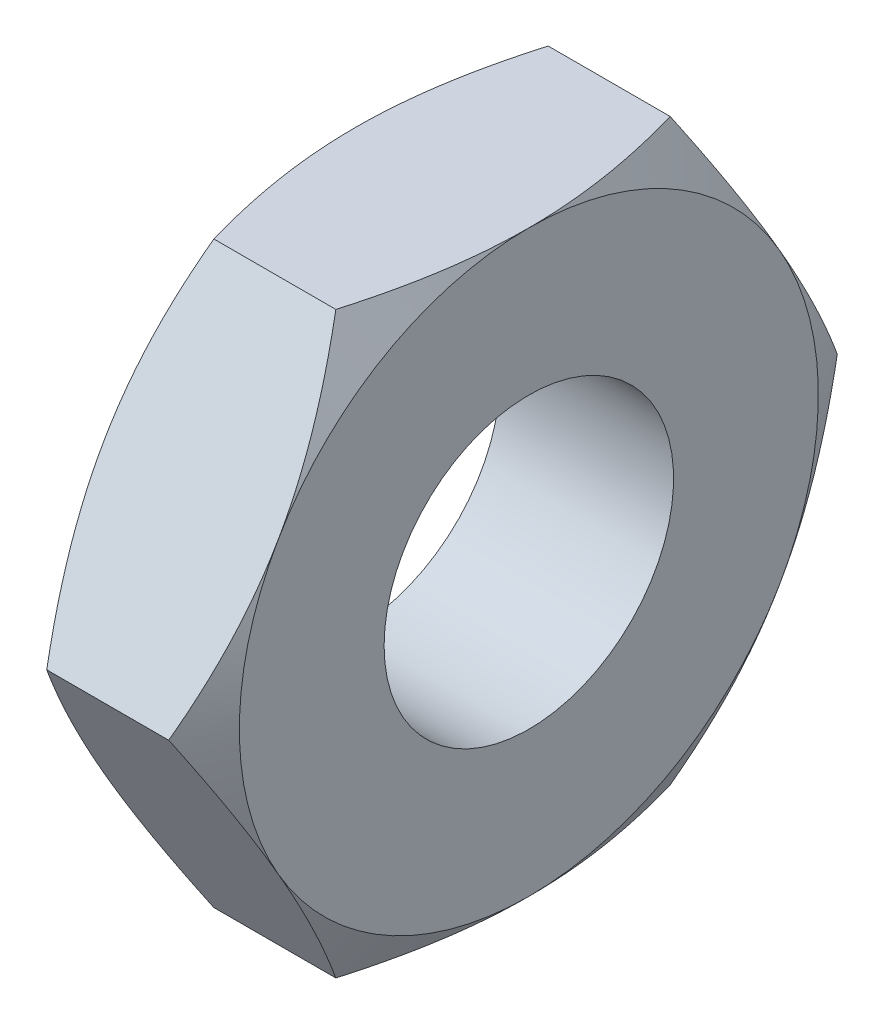
ISO-10303-21;
HEADER;
FILE_DESCRIPTION(('STEP AP214'),'2;1');
FILE_NAME('part.step','',(''),(''),'','','');
FILE_SCHEMA(('AUTOMOTIVE_DESIGN { 1 0 10303 214 1 1 1 1 }'));
ENDSEC;
DATA;
#1=APPLICATION_CONTEXT('core data for automotive mechanical design processes');
#2=APPLICATION_PROTOCOL_DEFINITION('international standard','automotive_design',2000,#1);
#3=PRODUCT_CONTEXT('',#1,'mechanical');
#4=PRODUCT('Part','Part','',(#3));
#5=PRODUCT_RELATED_PRODUCT_CATEGORY('part','',(#4));
#6=PRODUCT_DEFINITION_FORMATION('','',#4);
#7=PRODUCT_DEFINITION_CONTEXT('part definition',#1,'design');
#8=PRODUCT_DEFINITION('design','',#6,#7);
#9=PRODUCT_DEFINITION_SHAPE('','',#8);
#10=(LENGTH_UNIT() NAMED_UNIT(*) SI_UNIT(.MILLI.,.METRE.));
#11=(NAMED_UNIT(*) PLANE_ANGLE_UNIT() SI_UNIT($,.RADIAN.));
#12=(NAMED_UNIT(*) SI_UNIT($,.STERADIAN.) SOLID_ANGLE_UNIT());
#13=UNCERTAINTY_MEASURE_WITH_UNIT(LENGTH_MEASURE(1.E-05),#10,'distance_accuracy_value','');
#14=(GEOMETRIC_REPRESENTATION_CONTEXT(3) GLOBAL_UNCERTAINTY_ASSIGNED_CONTEXT((#13)) GLOBAL_UNIT_ASSIGNED_CONTEXT((#10,
#11,#12)) REPRESENTATION_CONTEXT('',''));
#15=CARTESIAN_POINT('',(0.,0.,0.));
#16=DIRECTION('',(0.,0.,1.));
#17=DIRECTION('',(1.,0.,0.));
#18=AXIS2_PLACEMENT_3D('',#15,#16,#17);
#19=CARTESIAN_POINT('',(3.,-5.,-2.88675134594813));
#20=DIRECTION('',(0.,0.5,0.866025403784439));
#21=DIRECTION('',(0.,-0.866025403784439,0.5));
#22=AXIS2_PLACEMENT_3D('',#19,#20,#21);
#23=PLANE('',#22);
#24=CARTESIAN_POINT('',(2.55335134394817,-5.0002,-2.88663587589429));
#25=CARTESIAN_POINT('',(2.62661343236237,-4.78046540547482,-3.01349970319368));
#26=CARTESIAN_POINT('',(2.69324867808191,-4.55885141554042,-3.14144859993849));
#27=CARTESIAN_POINT('',(2.80956100898919,-4.11178600454649,-3.39956193532121));
#28=CARTESIAN_POINT('',(2.85919695008421,-3.88632664040923,-3.52973095989718));
#29=CARTESIAN_POINT('',(2.9364489745813,-3.43816769477649,-3.78847564779798));
#30=CARTESIAN_POINT('',(2.96457962171651,-3.21553790689581,-3.91701101576052));
#31=CARTESIAN_POINT('',(2.98980507804631,-2.88081009815336,-4.11026620624322));
#32=CARTESIAN_POINT('',(2.99538654023052,-2.76915780319494,-4.17472868879311));
#33=CARTESIAN_POINT('',(3.00079778324853,-2.54575002932621,-4.30371322717528));
#34=CARTESIAN_POINT('',(3.0006277417418,-2.43399455370969,-4.36823528110589));
#35=CARTESIAN_POINT('',(2.99224636820796,-2.12781576914936,-4.54500768479194));
#36=CARTESIAN_POINT('',(2.97817022810275,-1.93349391403279,-4.65719946015292));
#37=CARTESIAN_POINT('',(2.93353474289057,-1.5461398980023,-4.88083840557981));
#38=CARTESIAN_POINT('',(2.90296013985249,-1.35310909862843,-4.9922847895602));
#39=CARTESIAN_POINT('',(2.82653150637884,-0.964974657525147,-5.21637431361295));
#40=CARTESIAN_POINT('',(2.78035362112132,-0.769920001358266,-5.32898917185759));
#41=CARTESIAN_POINT('',(2.67554820550807,-0.382719654641233,-5.55253939626498));
#42=CARTESIAN_POINT('',(2.61694529656263,-0.190569004591915,-5.66347762579592));
#43=CARTESIAN_POINT('',(2.55335134394818,0.000199999999998767,-5.7736181619501));
#44=B_SPLINE_CURVE_WITH_KNOTS('',3,(#24,#25,#26,#27,#28,#29,#30,#31,#32,#33,#34,#35,#36,#37,#38,
#39,#40,#41,#42,#43),.UNSPECIFIED.,.F.,.F.,(4,2,2,2,2,2,2,2,2,4),(0.,0.792555841363092,
1.58701660053333,2.3618153748728,2.74884076077325,3.13585419177295,3.80962362599679,
4.48401723901189,5.17336882348929,5.86136694793725),.UNSPECIFIED.);
#45=CARTESIAN_POINT('',(2.5534180126148,-5.,-2.88675134594812));
#46=VERTEX_POINT('',#45);
#47=CARTESIAN_POINT('',(3.,-2.5,-4.33012701892219));
#48=VERTEX_POINT('',#47);
#49=EDGE_CURVE('E203',#46,#48,#44,.T.);
#50=ORIENTED_EDGE('',*,*,#49,.F.);
#51=DIRECTION('',(-1.,0.,0.));
#52=VECTOR('',#51,1.);
#53=CARTESIAN_POINT('',(3.,-5.,-2.88675134594813));
#54=LINE('',#53,#52);
#55=CARTESIAN_POINT('',(0.446581987385198,-5.,-2.88675134594812));
#56=VERTEX_POINT('',#55);
#57=EDGE_CURVE('E153',#46,#56,#54,.T.);
#58=ORIENTED_EDGE('',*,*,#57,.T.);
#59=CARTESIAN_POINT('',(0.446648656051824,0.000199999999999153,-5.7736181619501));
#60=CARTESIAN_POINT('',(0.373386567637632,-0.219534594525186,-5.64675433465071));
#61=CARTESIAN_POINT('',(0.306751321918089,-0.441148584459581,-5.5188054379059));
#62=CARTESIAN_POINT('',(0.190438991010809,-0.888213995453514,-5.26069210252318));
#63=CARTESIAN_POINT('',(0.140803049915788,-1.11367335959077,-5.13052307794721));
#64=CARTESIAN_POINT('',(0.0635510254186975,-1.56183230522351,-4.87177839004641));
#65=CARTESIAN_POINT('',(0.0354203782834893,-1.78446209310419,-4.74324302208387));
#66=CARTESIAN_POINT('',(0.0101949219536848,-2.11918990184664,-4.54998783160116));
#67=CARTESIAN_POINT('',(0.00461345976948443,-2.23084219680506,-4.48552534905128));
#68=CARTESIAN_POINT('',(-0.000797783248529124,-2.4542499706738,-4.35654081066911));
#69=CARTESIAN_POINT('',(-0.000627741741795932,-2.56600544629031,-4.2920187567385));
#70=CARTESIAN_POINT('',(0.00775363179203732,-2.87218423085064,-4.11524635305244));
#71=CARTESIAN_POINT('',(0.0218297718972525,-3.06650608596721,-4.00305457769146));
#72=CARTESIAN_POINT('',(0.0664652571094315,-3.45386010199771,-3.77941563226458));
#73=CARTESIAN_POINT('',(0.0970398601475084,-3.64689090137157,-3.66796924828419));
#74=CARTESIAN_POINT('',(0.173468493621163,-4.03502534247486,-3.44387972423144));
#75=CARTESIAN_POINT('',(0.219646378878679,-4.23007999864174,-3.3312648659868));
#76=CARTESIAN_POINT('',(0.324451794491933,-4.61728034535877,-3.1077146415794));
#77=CARTESIAN_POINT('',(0.383054703437373,-4.80943099540809,-2.99677641204847));
#78=CARTESIAN_POINT('',(0.446648656051827,-5.0002,-2.88663587589429));
#79=B_SPLINE_CURVE_WITH_KNOTS('',3,(#59,#60,#61,#62,#63,#64,#65,#66,#67,#68,#69,#70,#71,#72,#73,
#74,#75,#76,#77,#78),.UNSPECIFIED.,.F.,.F.,(4,2,2,2,2,2,2,2,2,4),(0.,0.79255584136309,
1.58701660053333,2.3618153748728,2.74884076077325,3.13585419177295,3.80962362599679,
4.48401723901189,5.17336882348929,5.86136694793725),.UNSPECIFIED.);
#80=CARTESIAN_POINT('',(0.,-2.5,-4.33012701892219));
#81=VERTEX_POINT('',#80);
#82=EDGE_CURVE('E196',#81,#56,#79,.T.);
#83=ORIENTED_EDGE('',*,*,#82,.F.);
#84=CARTESIAN_POINT('',(0.446581987385198,0.,-5.77350269189626));
#85=VERTEX_POINT('',#84);
#86=EDGE_CURVE('E346',#85,#81,#79,.T.);
#87=ORIENTED_EDGE('',*,*,#86,.F.);
#88=DIRECTION('',(-1.,0.,0.));
#89=VECTOR('',#88,1.);
#90=CARTESIAN_POINT('',(3.,0.,-5.77350269189626));
#91=LINE('',#90,#89);
#92=CARTESIAN_POINT('',(2.5534180126148,0.,-5.77350269189626));
#93=VERTEX_POINT('',#92);
#94=EDGE_CURVE('E158',#93,#85,#91,.T.);
#95=ORIENTED_EDGE('',*,*,#94,.F.);
#96=EDGE_CURVE('E284',#48,#93,#44,.T.);
#97=ORIENTED_EDGE('',*,*,#96,.F.);
#98=EDGE_LOOP('',(#50,#58,#83,#87,#95,#97));
#99=FACE_BOUND('',#98,.T.);
#100=ADVANCED_FACE('F35',(#99),#23,.F.);
#101=CARTESIAN_POINT('',(3.,0.,-5.77350269189626));
#102=DIRECTION('',(0.,-0.5,0.866025403784439));
#103=DIRECTION('',(0.,-0.866025403784439,-0.5));
#104=AXIS2_PLACEMENT_3D('',#101,#102,#103);
#105=PLANE('',#104);
#106=CARTESIAN_POINT('',(2.55335134394818,-0.000200000000000871,-5.7736181619501));
#107=CARTESIAN_POINT('',(2.62661343236237,0.219534594525184,-5.64675433465071));
#108=CARTESIAN_POINT('',(2.69324867808191,0.441148584459579,-5.5188054379059));
#109=CARTESIAN_POINT('',(2.80956100898919,0.888213995453511,-5.26069210252318));
#110=CARTESIAN_POINT('',(2.85919695008421,1.11367335959077,-5.13052307794721));
#111=CARTESIAN_POINT('',(2.9364489745813,1.56183230522351,-4.87177839004641));
#112=CARTESIAN_POINT('',(2.96457962171651,1.78446209310419,-4.74324302208387));
#113=CARTESIAN_POINT('',(2.98980507804632,2.11918990184664,-4.54998783160116));
#114=CARTESIAN_POINT('',(2.99538654023052,2.23084219680506,-4.48552534905128));
#115=CARTESIAN_POINT('',(3.00079778324853,2.45424997067379,-4.35654081066911));
#116=CARTESIAN_POINT('',(3.0006277417418,2.56600544629031,-4.2920187567385));
#117=CARTESIAN_POINT('',(2.99224636820796,2.87218423085064,-4.11524635305245));
#118=CARTESIAN_POINT('',(2.97817022810275,3.06650608596721,-4.00305457769146));
#119=CARTESIAN_POINT('',(2.93353474289057,3.45386010199771,-3.77941563226457));
#120=CARTESIAN_POINT('',(2.90296013985249,3.64689090137157,-3.66796924828419));
#121=CARTESIAN_POINT('',(2.82653150637884,4.03502534247486,-3.44387972423144));
#122=CARTESIAN_POINT('',(2.78035362112132,4.23007999864174,-3.3312648659868));
#123=CARTESIAN_POINT('',(2.67554820550807,4.61728034535877,-3.1077146415794));
#124=CARTESIAN_POINT('',(2.61694529656263,4.80943099540809,-2.99677641204847));
#125=CARTESIAN_POINT('',(2.55335134394817,5.0002,-2.88663587589429));
#126=B_SPLINE_CURVE_WITH_KNOTS('',3,(#106,#107,#108,#109,#110,#111,#112,#113,#114,#115,#116,
#117,#118,#119,#120,#121,#122,#123,#124,#125),.UNSPECIFIED.,.F.,.F.,(4,2,2,2,2,2,2,2,2,4),(0.,
0.792555841363089,1.58701660053333,2.3618153748728,2.74884076077325,3.13585419177294,
3.80962362599679,4.48401723901189,5.17336882348929,5.86136694793726),.UNSPECIFIED.);
#127=CARTESIAN_POINT('',(3.,2.5,-4.33012701892219));
#128=VERTEX_POINT('',#127);
#129=EDGE_CURVE('E277',#93,#128,#126,.T.);
#130=ORIENTED_EDGE('',*,*,#129,.F.);
#131=ORIENTED_EDGE('',*,*,#94,.T.);
#132=CARTESIAN_POINT('',(0.446648656051826,5.0002,-2.88663587589429));
#133=CARTESIAN_POINT('',(0.373386567637633,4.78046540547482,-3.01349970319368));
#134=CARTESIAN_POINT('',(0.306751321918091,4.55885141554042,-3.14144859993849));
#135=CARTESIAN_POINT('',(0.19043899101081,4.11178600454649,-3.39956193532121));
#136=CARTESIAN_POINT('',(0.140803049915789,3.88632664040923,-3.52973095989717));
#137=CARTESIAN_POINT('',(0.0635510254186983,3.4381676947765,-3.78847564779797));
#138=CARTESIAN_POINT('',(0.0354203782834904,3.21553790689581,-3.91701101576052));
#139=CARTESIAN_POINT('',(0.0101949219536852,2.88081009815336,-4.11026620624322));
#140=CARTESIAN_POINT('',(0.00461345976948439,2.76915780319494,-4.1747286887931));
#141=CARTESIAN_POINT('',(-0.000797783248529586,2.54575002932621,-4.30371322717527));
#142=CARTESIAN_POINT('',(-0.000627741741796367,2.43399455370969,-4.36823528110588));
#143=CARTESIAN_POINT('',(0.00775363179203669,2.12781576914937,-4.54500768479194));
#144=CARTESIAN_POINT('',(0.0218297718972514,1.93349391403279,-4.65719946015292));
#145=CARTESIAN_POINT('',(0.0664652571094301,1.5461398980023,-4.88083840557981));
#146=CARTESIAN_POINT('',(0.097039860147507,1.35310909862843,-4.9922847895602));
#147=CARTESIAN_POINT('',(0.173468493621162,0.964974657525147,-5.21637431361295));
#148=CARTESIAN_POINT('',(0.219646378878678,0.769920001358266,-5.32898917185759));
#149=CARTESIAN_POINT('',(0.324451794491931,0.382719654641232,-5.55253939626498));
#150=CARTESIAN_POINT('',(0.38305470343737,0.190569004591913,-5.66347762579592));
#151=CARTESIAN_POINT('',(0.446648656051824,-0.000200000000000907,-5.7736181619501));
#152=B_SPLINE_CURVE_WITH_KNOTS('',3,(#132,#133,#134,#135,#136,#137,#138,#139,#140,#141,#142,
#143,#144,#145,#146,#147,#148,#149,#150,#151),.UNSPECIFIED.,.F.,.F.,(4,2,2,2,2,2,2,2,2,4),(0.,
0.79255584136309,1.58701660053333,2.3618153748728,2.74884076077325,3.13585419177295,
3.80962362599679,4.48401723901189,5.17336882348929,5.86136694793726),.UNSPECIFIED.);
#153=CARTESIAN_POINT('',(0.,2.5,-4.33012701892219));
#154=VERTEX_POINT('',#153);
#155=EDGE_CURVE('E250',#154,#85,#152,.T.);
#156=ORIENTED_EDGE('',*,*,#155,.F.);
#157=CARTESIAN_POINT('',(0.446581987385198,5.,-2.88675134594812));
#158=VERTEX_POINT('',#157);
#159=EDGE_CURVE('E255',#158,#154,#152,.T.);
#160=ORIENTED_EDGE('',*,*,#159,.F.);
#161=DIRECTION('',(-1.,0.,0.));
#162=VECTOR('',#161,1.);
#163=CARTESIAN_POINT('',(3.,5.,-2.88675134594813));
#164=LINE('',#163,#162);
#165=CARTESIAN_POINT('',(2.5534180126148,5.,-2.88675134594812));
#166=VERTEX_POINT('',#165);
#167=EDGE_CURVE('E151',#166,#158,#164,.T.);
#168=ORIENTED_EDGE('',*,*,#167,.F.);
#169=EDGE_CURVE('E271',#128,#166,#126,.T.);
#170=ORIENTED_EDGE('',*,*,#169,.F.);
#171=EDGE_LOOP('',(#130,#131,#156,#160,#168,#170));
#172=FACE_BOUND('',#171,.T.);
#173=ADVANCED_FACE('F263',(#172),#105,.F.);
#174=CARTESIAN_POINT('',(3.,5.,-2.88675134594813));
#175=DIRECTION('',(0.,-1.,0.));
#176=DIRECTION('',(0.,0.,-1.));
#177=AXIS2_PLACEMENT_3D('',#174,#175,#176);
#178=PLANE('',#177);
#179=CARTESIAN_POINT('',(0.60736647344924,5.,-7.65608998744865));
#180=CARTESIAN_POINT('',(0.713454661827966,5.,-7.43656171400166));
#181=CARTESIAN_POINT('',(0.81848824538408,5.,-7.21651440170021));
#182=CARTESIAN_POINT('',(1.02584356636027,5.,-6.77510105921518));
#183=CARTESIAN_POINT('',(1.12816483425435,5.,-6.55373480873052));
#184=CARTESIAN_POINT('',(1.33003192146512,5.,-6.10820714710356));
#185=CARTESIAN_POINT('',(1.42955850718272,5.,-5.88403698971124));
#186=CARTESIAN_POINT('',(1.62433676721321,5.,-5.43385418074676));
#187=CARTESIAN_POINT('',(1.71958866435759,5.,-5.20784162594277));
#188=CARTESIAN_POINT('',(1.90581169081061,5.,-4.75080884782755));
#189=CARTESIAN_POINT('',(1.99671590900132,5.,-4.51976121099504));
#190=CARTESIAN_POINT('',(2.17140469702806,5.,-4.05494053422099));
#191=CARTESIAN_POINT('',(2.25518847475236,5.,-3.82116719434024));
#192=CARTESIAN_POINT('',(2.41338536763539,5.,-3.35100416711888));
#193=CARTESIAN_POINT('',(2.48781840477474,5.,-3.11462125088187));
#194=CARTESIAN_POINT('',(2.62489560612763,5.,-2.63849247870023));
#195=CARTESIAN_POINT('',(2.68754349840305,5.,-2.3987477121033));
#196=CARTESIAN_POINT('',(2.79801224600513,5.,-1.91574303714496));
#197=CARTESIAN_POINT('',(2.84582915344136,5.,-1.67248221084099));
#198=CARTESIAN_POINT('',(2.9234044442076,5.,-1.18299359688664));
#199=CARTESIAN_POINT('',(2.95316281157159,5.,-0.936765806613277));
#200=CARTESIAN_POINT('',(2.9823487984137,5.,-0.567032279323844));
#201=CARTESIAN_POINT('',(2.98950368094005,5.,-0.444105297658536));
#202=CARTESIAN_POINT('',(2.99860454773096,5.,-0.198053005238561));
#203=CARTESIAN_POINT('',(3.00055059963961,5.,-0.0749276970802247));
#204=CARTESIAN_POINT('',(2.99918152965433,5.,0.171257999892357));
#205=CARTESIAN_POINT('',(2.99586788568699,5.,0.294318397227091));
#206=CARTESIAN_POINT('',(2.98406340271724,5.,0.540192730788843));
#207=CARTESIAN_POINT('',(2.97557230242983,5.,0.663006654263485));
#208=CARTESIAN_POINT('',(2.9488936197247,5.,0.960681872881672));
#209=CARTESIAN_POINT('',(2.92811103230171,5.,1.13531436279941));
#210=CARTESIAN_POINT('',(2.8772343442773,5.,1.48321675799391));
#211=CARTESIAN_POINT('',(2.84713900200996,5.,1.65648647841238));
#212=CARTESIAN_POINT('',(2.77870120798844,5.,2.00155426058702));
#213=CARTESIAN_POINT('',(2.74035052251359,5.,2.17335067370376));
#214=CARTESIAN_POINT('',(2.65657169461498,5.,2.51518168221058));
#215=CARTESIAN_POINT('',(2.61114398308599,5.,2.68521638419315));
#216=CARTESIAN_POINT('',(2.5131122179457,5.,3.02770318928897));
#217=CARTESIAN_POINT('',(2.46035963617605,5.,3.20011248435317));
#218=CARTESIAN_POINT('',(2.34964221269736,5.,3.54310870430183));
#219=CARTESIAN_POINT('',(2.29168096609292,5.,3.71369679659721));
#220=CARTESIAN_POINT('',(2.17174345927151,5.,4.05236610267981));
#221=CARTESIAN_POINT('',(2.10979163457362,5.,4.22045602230063));
#222=CARTESIAN_POINT('',(1.98225176586186,5.,4.55533171687456));
#223=CARTESIAN_POINT('',(1.91666225221221,5.,4.72211693321423));
#224=CARTESIAN_POINT('',(1.84961374182274,5.,4.88829623733364));
#225=B_SPLINE_CURVE_WITH_KNOTS('',3,(#179,#180,#181,#182,#183,#184,#185,#186,#187,#188,#189,
#190,#191,#192,#193,#194,#195,#196,#197,#198,#199,#200,#201,#202,#203,#204,#205,#206,#207,#208,
#209,#210,#211,#212,#213,#214,#215,#216,#217,#218,#219,#220,#221,#222,#223,#224),.UNSPECIFIED.,
.F.,.F.,(4,2,2,2,2,2,2,2,2,2,2,2,2,2,2,2,2,2,2,2,2,2,4),(0.,0.731464740665351,1.46305528824908,
2.19883243307486,2.93457117856033,3.67934251246857,4.42419659013361,5.16743580871988,
5.91043951739338,6.65364083834805,7.39684281638514,7.76615414335455,8.13546067426609,
8.50466345177854,8.87388486298451,9.40118542949727,9.92855633110016,10.4564556797854,
10.9843228991235,11.5251202808281,12.0655472210641,12.6029322754131,13.1405360390027),.UNSPECIFIED.);
#226=CARTESIAN_POINT('',(3.,5.,0.));
#227=VERTEX_POINT('',#226);
#228=EDGE_CURVE('E278',#166,#227,#225,.T.);
#229=ORIENTED_EDGE('',*,*,#228,.F.);
#230=ORIENTED_EDGE('',*,*,#167,.T.);
#231=CARTESIAN_POINT('',(2.39263352655076,5.,-7.65608998744865));
#232=CARTESIAN_POINT('',(2.28654533817204,5.,-7.43656171400166));
#233=CARTESIAN_POINT('',(2.18151175461592,5.,-7.21651440170021));
#234=CARTESIAN_POINT('',(1.97415643363973,5.,-6.77510105921518));
#235=CARTESIAN_POINT('',(1.87183516574565,5.,-6.55373480873052));
#236=CARTESIAN_POINT('',(1.66996807853488,5.,-6.10820714710356));
#237=CARTESIAN_POINT('',(1.57044149281728,5.,-5.88403698971124));
#238=CARTESIAN_POINT('',(1.37566323278679,5.,-5.43385418074676));
#239=CARTESIAN_POINT('',(1.28041133564241,5.,-5.20784162594277));
#240=CARTESIAN_POINT('',(1.09418830918939,5.,-4.75080884782755));
#241=CARTESIAN_POINT('',(1.00328409099868,5.,-4.51976121099504));
#242=CARTESIAN_POINT('',(0.828595302971936,5.,-4.05494053422099));
#243=CARTESIAN_POINT('',(0.74481152524764,5.,-3.82116719434024));
#244=CARTESIAN_POINT('',(0.58661463236461,5.,-3.35100416711888));
#245=CARTESIAN_POINT('',(0.512181595225263,5.,-3.11462125088187));
#246=CARTESIAN_POINT('',(0.375104393872372,5.,-2.63849247870023));
#247=CARTESIAN_POINT('',(0.312456501596946,5.,-2.3987477121033));
#248=CARTESIAN_POINT('',(0.201987753994868,5.,-1.91574303714496));
#249=CARTESIAN_POINT('',(0.154170846558641,5.,-1.67248221084099));
#250=CARTESIAN_POINT('',(0.0765955557924036,5.,-1.18299359688664));
#251=CARTESIAN_POINT('',(0.0468371884284112,5.,-0.936765806613277));
#252=CARTESIAN_POINT('',(0.017651201586299,5.,-0.567032279323844));
#253=CARTESIAN_POINT('',(0.0104963190599496,5.,-0.444105297658536));
#254=CARTESIAN_POINT('',(0.00139545226904362,5.,-0.198053005238561));
#255=CARTESIAN_POINT('',(-0.000550599639611621,5.,-0.0749276970802248));
#256=CARTESIAN_POINT('',(0.000818470345667009,5.,0.171257999892356));
#257=CARTESIAN_POINT('',(0.00413211431301458,5.,0.294318397227091));
#258=CARTESIAN_POINT('',(0.0159365972827629,5.,0.540192730788843));
#259=CARTESIAN_POINT('',(0.0244276975701677,5.,0.663006654263485));
#260=CARTESIAN_POINT('',(0.0511063802753035,5.,0.960681872881672));
#261=CARTESIAN_POINT('',(0.0718889676982891,5.,1.13531436279941));
#262=CARTESIAN_POINT('',(0.122765655722699,5.,1.48321675799391));
#263=CARTESIAN_POINT('',(0.152860997990038,5.,1.65648647841238));
#264=CARTESIAN_POINT('',(0.221298792011556,5.,2.00155426058702));
#265=CARTESIAN_POINT('',(0.25964947748641,5.,2.17335067370376));
#266=CARTESIAN_POINT('',(0.343428305385018,5.,2.51518168221058));
#267=CARTESIAN_POINT('',(0.38885601691401,5.,2.68521638419315));
#268=CARTESIAN_POINT('',(0.486887782054302,5.,3.02770318928897));
#269=CARTESIAN_POINT('',(0.539640363823952,5.,3.20011248435317));
#270=CARTESIAN_POINT('',(0.650357787302638,5.,3.54310870430183));
#271=CARTESIAN_POINT('',(0.708319033907083,5.,3.71369679659721));
#272=CARTESIAN_POINT('',(0.828256540728489,5.,4.05236610267981));
#273=CARTESIAN_POINT('',(0.890208365426381,5.,4.22045602230063));
#274=CARTESIAN_POINT('',(1.01774823413814,5.,4.55533171687457));
#275=CARTESIAN_POINT('',(1.08333774778779,5.,4.72211693321423));
#276=CARTESIAN_POINT('',(1.15038625817726,5.,4.88829623733365));
#277=B_SPLINE_CURVE_WITH_KNOTS('',3,(#231,#232,#233,#234,#235,#236,#237,#238,#239,#240,#241,
#242,#243,#244,#245,#246,#247,#248,#249,#250,#251,#252,#253,#254,#255,#256,#257,#258,#259,#260,
#261,#262,#263,#264,#265,#266,#267,#268,#269,#270,#271,#272,#273,#274,#275,#276),.UNSPECIFIED.,
.F.,.F.,(4,2,2,2,2,2,2,2,2,2,2,2,2,2,2,2,2,2,2,2,2,2,4),(0.,0.73146474066535,1.46305528824908,
2.19883243307486,2.93457117856033,3.67934251246857,4.42419659013361,5.16743580871988,
5.91043951739338,6.65364083834805,7.39684281638514,7.76615414335455,8.13546067426609,
8.50466345177854,8.87388486298451,9.40118542949727,9.92855633110016,10.4564556797854,
10.9843228991235,11.5251202808281,12.0655472210641,12.6029322754131,13.1405360390027),.UNSPECIFIED.);
#278=CARTESIAN_POINT('',(0.,5.,0.));
#279=VERTEX_POINT('',#278);
#280=EDGE_CURVE('E256',#279,#158,#277,.F.);
#281=ORIENTED_EDGE('',*,*,#280,.F.);
#282=CARTESIAN_POINT('',(0.446581987385198,5.,2.88675134594813));
#283=VERTEX_POINT('',#282);
#284=EDGE_CURVE('E338',#283,#279,#277,.F.);
#285=ORIENTED_EDGE('',*,*,#284,.F.);
#286=DIRECTION('',(-1.,0.,0.));
#287=VECTOR('',#286,1.);
#288=CARTESIAN_POINT('',(3.,5.,2.88675134594813));
#289=LINE('',#288,#287);
#290=CARTESIAN_POINT('',(2.5534180126148,5.,2.88675134594813));
#291=VERTEX_POINT('',#290);
#292=EDGE_CURVE('E148',#291,#283,#289,.T.);
#293=ORIENTED_EDGE('',*,*,#292,.F.);
#294=EDGE_CURVE('E279',#227,#291,#225,.T.);
#295=ORIENTED_EDGE('',*,*,#294,.F.);
#296=EDGE_LOOP('',(#229,#230,#281,#285,#293,#295));
#297=FACE_BOUND('',#296,.T.);
#298=ADVANCED_FACE('F266',(#297),#178,.F.);
#299=CARTESIAN_POINT('',(3.,5.,2.88675134594813));
#300=DIRECTION('',(0.,-0.5,-0.866025403784439));
#301=DIRECTION('',(0.,0.866025403784439,-0.5));
#302=AXIS2_PLACEMENT_3D('',#299,#300,#301);
#303=PLANE('',#302);
#304=CARTESIAN_POINT('',(2.55335134394817,5.0002,2.88663587589429));
#305=CARTESIAN_POINT('',(2.62661343236237,4.78046540547482,3.01349970319368));
#306=CARTESIAN_POINT('',(2.69324867808191,4.55885141554042,3.14144859993849));
#307=CARTESIAN_POINT('',(2.80956100898919,4.11178600454649,3.39956193532121));
#308=CARTESIAN_POINT('',(2.85919695008421,3.88632664040923,3.52973095989718));
#309=CARTESIAN_POINT('',(2.9364489745813,3.43816769477649,3.78847564779798));
#310=CARTESIAN_POINT('',(2.96457962171651,3.21553790689581,3.91701101576052));
#311=CARTESIAN_POINT('',(2.98980507804631,2.88081009815336,4.11026620624323));
#312=CARTESIAN_POINT('',(2.99538654023051,2.76915780319494,4.17472868879311));
#313=CARTESIAN_POINT('',(3.00079778324853,2.54575002932621,4.30371322717528));
#314=CARTESIAN_POINT('',(3.00062774174179,2.43399455370969,4.36823528110589));
#315=CARTESIAN_POINT('',(2.99224636820796,2.12781576914936,4.54500768479194));
#316=CARTESIAN_POINT('',(2.97817022810275,1.93349391403279,4.65719946015293));
#317=CARTESIAN_POINT('',(2.93353474289057,1.5461398980023,4.88083840557981));
#318=CARTESIAN_POINT('',(2.90296013985249,1.35310909862843,4.9922847895602));
#319=CARTESIAN_POINT('',(2.82653150637884,0.964974657525147,5.21637431361295));
#320=CARTESIAN_POINT('',(2.78035362112132,0.769920001358266,5.32898917185759));
#321=CARTESIAN_POINT('',(2.67554820550807,0.382719654641233,5.55253939626498));
#322=CARTESIAN_POINT('',(2.61694529656263,0.190569004591914,5.66347762579592));
#323=CARTESIAN_POINT('',(2.55335134394817,-0.000200000000000019,5.7736181619501));
#324=B_SPLINE_CURVE_WITH_KNOTS('',3,(#304,#305,#306,#307,#308,#309,#310,#311,#312,#313,#314,
#315,#316,#317,#318,#319,#320,#321,#322,#323),.UNSPECIFIED.,.F.,.F.,(4,2,2,2,2,2,2,2,2,4),(0.,
0.792555841363092,1.58701660053333,2.3618153748728,2.74884076077325,3.13585419177295,
3.80962362599679,4.48401723901189,5.17336882348929,5.86136694793726),.UNSPECIFIED.);
#325=CARTESIAN_POINT('',(3.,2.5,4.33012701892219));
#326=VERTEX_POINT('',#325);
#327=EDGE_CURVE('E133',#291,#326,#324,.T.);
#328=ORIENTED_EDGE('',*,*,#327,.F.);
#329=ORIENTED_EDGE('',*,*,#292,.T.);
#330=CARTESIAN_POINT('',(0.446648656051826,-0.000200000000000197,5.7736181619501));
#331=CARTESIAN_POINT('',(0.373386567637633,0.219534594525185,5.64675433465071));
#332=CARTESIAN_POINT('',(0.306751321918091,0.441148584459581,5.5188054379059));
#333=CARTESIAN_POINT('',(0.190438991010811,0.888213995453513,5.26069210252318));
#334=CARTESIAN_POINT('',(0.140803049915789,1.11367335959077,5.13052307794721));
#335=CARTESIAN_POINT('',(0.0635510254186992,1.56183230522351,4.87177839004641));
#336=CARTESIAN_POINT('',(0.0354203782834909,1.78446209310419,4.74324302208387));
#337=CARTESIAN_POINT('',(0.0101949219536863,2.11918990184664,4.54998783160117));
#338=CARTESIAN_POINT('',(0.00461345976948575,2.23084219680506,4.48552534905128));
#339=CARTESIAN_POINT('',(-0.000797783248527949,2.4542499706738,4.35654081066911));
#340=CARTESIAN_POINT('',(-0.000627741741794768,2.56600544629031,4.2920187567385));
#341=CARTESIAN_POINT('',(0.00775363179203835,2.87218423085064,4.11524635305245));
#342=CARTESIAN_POINT('',(0.0218297718972533,3.06650608596721,4.00305457769146));
#343=CARTESIAN_POINT('',(0.0664652571094323,3.45386010199771,3.77941563226458));
#344=CARTESIAN_POINT('',(0.0970398601475095,3.64689090137157,3.66796924828419));
#345=CARTESIAN_POINT('',(0.173468493621164,4.03502534247486,3.44387972423144));
#346=CARTESIAN_POINT('',(0.21964637887868,4.23007999864174,3.3312648659868));
#347=CARTESIAN_POINT('',(0.324451794491933,4.61728034535877,3.10771464157941));
#348=CARTESIAN_POINT('',(0.383054703437373,4.80943099540809,2.99677641204847));
#349=CARTESIAN_POINT('',(0.446648656051827,5.0002,2.88663587589429));
#350=B_SPLINE_CURVE_WITH_KNOTS('',3,(#330,#331,#332,#333,#334,#335,#336,#337,#338,#339,#340,
#341,#342,#343,#344,#345,#346,#347,#348,#349),.UNSPECIFIED.,.F.,.F.,(4,2,2,2,2,2,2,2,2,4),(0.,
0.79255584136309,1.58701660053333,2.3618153748728,2.74884076077325,3.13585419177295,
3.80962362599679,4.48401723901189,5.17336882348929,5.86136694793726),.UNSPECIFIED.);
#351=CARTESIAN_POINT('',(0.,2.5,4.33012701892219));
#352=VERTEX_POINT('',#351);
#353=EDGE_CURVE('E344',#352,#283,#350,.T.);
#354=ORIENTED_EDGE('',*,*,#353,.F.);
#355=CARTESIAN_POINT('',(0.446581987385198,0.,5.77350269189626));
#356=VERTEX_POINT('',#355);
#357=EDGE_CURVE('E147',#356,#352,#350,.T.);
#358=ORIENTED_EDGE('',*,*,#357,.F.);
#359=DIRECTION('',(-1.,0.,0.));
#360=VECTOR('',#359,1.);
#361=CARTESIAN_POINT('',(3.,0.,5.77350269189626));
#362=LINE('',#361,#360);
#363=CARTESIAN_POINT('',(2.5534180126148,0.,5.77350269189626));
#364=VERTEX_POINT('',#363);
#365=EDGE_CURVE('E139',#364,#356,#362,.T.);
#366=ORIENTED_EDGE('',*,*,#365,.F.);
#367=EDGE_CURVE('E125',#326,#364,#324,.T.);
#368=ORIENTED_EDGE('',*,*,#367,.F.);
#369=EDGE_LOOP('',(#328,#329,#354,#358,#366,#368));
#370=FACE_BOUND('',#369,.T.);
#371=ADVANCED_FACE('F145',(#370),#303,.F.);
#372=CARTESIAN_POINT('',(3.,0.,5.77350269189626));
#373=DIRECTION('',(0.,0.5,-0.866025403784439));
#374=DIRECTION('',(0.,0.866025403784439,0.5));
#375=AXIS2_PLACEMENT_3D('',#372,#373,#374);
#376=PLANE('',#375);
#377=CARTESIAN_POINT('',(2.55335134394817,0.00020000000000008,5.7736181619501));
#378=CARTESIAN_POINT('',(2.62661343236237,-0.219534594525185,5.64675433465071));
#379=CARTESIAN_POINT('',(2.69324867808191,-0.441148584459581,5.5188054379059));
#380=CARTESIAN_POINT('',(2.80956100898919,-0.888213995453513,5.26069210252318));
#381=CARTESIAN_POINT('',(2.85919695008421,-1.11367335959077,5.13052307794721));
#382=CARTESIAN_POINT('',(2.9364489745813,-1.56183230522351,4.87177839004641));
#383=CARTESIAN_POINT('',(2.96457962171651,-1.78446209310419,4.74324302208387));
#384=CARTESIAN_POINT('',(2.98980507804631,-2.11918990184664,4.54998783160117));
#385=CARTESIAN_POINT('',(2.99538654023051,-2.23084219680506,4.48552534905128));
#386=CARTESIAN_POINT('',(3.00079778324853,-2.4542499706738,4.35654081066911));
#387=CARTESIAN_POINT('',(3.0006277417418,-2.56600544629031,4.2920187567385));
#388=CARTESIAN_POINT('',(2.99224636820796,-2.87218423085064,4.11524635305245));
#389=CARTESIAN_POINT('',(2.97817022810275,-3.06650608596721,4.00305457769146));
#390=CARTESIAN_POINT('',(2.93353474289057,-3.45386010199771,3.77941563226458));
#391=CARTESIAN_POINT('',(2.90296013985249,-3.64689090137157,3.66796924828419));
#392=CARTESIAN_POINT('',(2.82653150637884,-4.03502534247485,3.44387972423144));
#393=CARTESIAN_POINT('',(2.78035362112132,-4.23007999864174,3.3312648659868));
#394=CARTESIAN_POINT('',(2.67554820550807,-4.61728034535877,3.10771464157941));
#395=CARTESIAN_POINT('',(2.61694529656263,-4.80943099540809,2.99677641204847));
#396=CARTESIAN_POINT('',(2.55335134394817,-5.0002,2.88663587589429));
#397=B_SPLINE_CURVE_WITH_KNOTS('',3,(#377,#378,#379,#380,#381,#382,#383,#384,#385,#386,#387,
#388,#389,#390,#391,#392,#393,#394,#395,#396),.UNSPECIFIED.,.F.,.F.,(4,2,2,2,2,2,2,2,2,4),(0.,
0.79255584136309,1.58701660053333,2.3618153748728,2.74884076077325,3.13585419177295,
3.80962362599679,4.48401723901189,5.17336882348929,5.86136694793725),.UNSPECIFIED.);
#398=CARTESIAN_POINT('',(3.,-2.5,4.33012701892219));
#399=VERTEX_POINT('',#398);
#400=EDGE_CURVE('E128',#364,#399,#397,.T.);
#401=ORIENTED_EDGE('',*,*,#400,.F.);
#402=ORIENTED_EDGE('',*,*,#365,.T.);
#403=CARTESIAN_POINT('',(0.446648656051826,-5.0002,2.88663587589429));
#404=CARTESIAN_POINT('',(0.373386567637633,-4.78046540547482,3.01349970319368));
#405=CARTESIAN_POINT('',(0.306751321918091,-4.55885141554042,3.14144859993849));
#406=CARTESIAN_POINT('',(0.190438991010811,-4.11178600454649,3.39956193532121));
#407=CARTESIAN_POINT('',(0.140803049915789,-3.88632664040923,3.52973095989718));
#408=CARTESIAN_POINT('',(0.0635510254186994,-3.43816769477649,3.78847564779798));
#409=CARTESIAN_POINT('',(0.0354203782834917,-3.21553790689581,3.91701101576052));
#410=CARTESIAN_POINT('',(0.0101949219536863,-2.88081009815336,4.11026620624323));
#411=CARTESIAN_POINT('',(0.00461345976948524,-2.76915780319494,4.17472868879311));
#412=CARTESIAN_POINT('',(-0.000797783248528441,-2.54575002932621,4.30371322717528));
#413=CARTESIAN_POINT('',(-0.000627741741794725,-2.43399455370969,4.36823528110589));
#414=CARTESIAN_POINT('',(0.00775363179203898,-2.12781576914936,4.54500768479194));
#415=CARTESIAN_POINT('',(0.0218297718972533,-1.93349391403279,4.65719946015293));
#416=CARTESIAN_POINT('',(0.0664652571094315,-1.5461398980023,4.88083840557981));
#417=CARTESIAN_POINT('',(0.0970398601475084,-1.35310909862843,4.9922847895602));
#418=CARTESIAN_POINT('',(0.173468493621163,-0.964974657525147,5.21637431361295));
#419=CARTESIAN_POINT('',(0.21964637887868,-0.769920001358266,5.32898917185759));
#420=CARTESIAN_POINT('',(0.324451794491933,-0.382719654641233,5.55253939626498));
#421=CARTESIAN_POINT('',(0.383054703437373,-0.190569004591914,5.66347762579592));
#422=CARTESIAN_POINT('',(0.446648656051826,0.000199999999999679,5.7736181619501));
#423=B_SPLINE_CURVE_WITH_KNOTS('',3,(#403,#404,#405,#406,#407,#408,#409,#410,#411,#412,#413,
#414,#415,#416,#417,#418,#419,#420,#421,#422),.UNSPECIFIED.,.F.,.F.,(4,2,2,2,2,2,2,2,2,4),(0.,
0.79255584136309,1.58701660053333,2.3618153748728,2.74884076077325,3.13585419177295,
3.80962362599679,4.48401723901189,5.17336882348929,5.86136694793725),.UNSPECIFIED.);
#424=CARTESIAN_POINT('',(0.,-2.5,4.33012701892219));
#425=VERTEX_POINT('',#424);
#426=EDGE_CURVE('E345',#425,#356,#423,.T.);
#427=ORIENTED_EDGE('',*,*,#426,.F.);
#428=CARTESIAN_POINT('',(0.446581987385198,-5.,2.88675134594812));
#429=VERTEX_POINT('',#428);
#430=EDGE_CURVE('E188',#429,#425,#423,.T.);
#431=ORIENTED_EDGE('',*,*,#430,.F.);
#432=DIRECTION('',(-1.,0.,0.));
#433=VECTOR('',#432,1.);
#434=CARTESIAN_POINT('',(3.,-5.,2.88675134594813));
#435=LINE('',#434,#433);
#436=CARTESIAN_POINT('',(2.5534180126148,-5.,2.88675134594812));
#437=VERTEX_POINT('',#436);
#438=EDGE_CURVE('E149',#437,#429,#435,.T.);
#439=ORIENTED_EDGE('',*,*,#438,.F.);
#440=EDGE_CURVE('E142',#399,#437,#397,.T.);
#441=ORIENTED_EDGE('',*,*,#440,.F.);
#442=EDGE_LOOP('',(#401,#402,#427,#431,#439,#441));
#443=FACE_BOUND('',#442,.T.);
#444=ADVANCED_FACE('F137',(#443),#376,.F.);
#445=CARTESIAN_POINT('',(3.,-5.,2.88675134594813));
#446=DIRECTION('',(0.,1.,0.));
#447=DIRECTION('',(0.,0.,1.));
#448=AXIS2_PLACEMENT_3D('',#445,#446,#447);
#449=PLANE('',#448);
#450=CARTESIAN_POINT('',(0.607365610745877,-5.00000000000001,-7.65609177212317));
#451=CARTESIAN_POINT('',(0.71345383603734,-5.00000000000001,-7.43656343758357));
#452=CARTESIAN_POINT('',(0.81848745648448,-5.00000000000001,-7.21651606414283));
#453=CARTESIAN_POINT('',(1.02584285104625,-5.00000000000001,-6.77510259917478));
#454=CARTESIAN_POINT('',(1.12816415563485,-5.00000000000001,-6.55373628734637));
#455=CARTESIAN_POINT('',(1.33003131625317,-5.00000000000001,-6.10820850200618));
#456=CARTESIAN_POINT('',(1.42955793867598,-5.00000000000001,-5.88403828224006));
#457=CARTESIAN_POINT('',(1.62433627144146,-5.00000000000001,-5.43385534806404));
#458=CARTESIAN_POINT('',(1.71958820461569,-5.00000000000001,-5.20784273042233));
#459=CARTESIAN_POINT('',(1.90581130250878,-5.00000000000001,-4.7508098249394));
#460=CARTESIAN_POINT('',(1.99671555609043,-5.,-4.5197621235661));
#461=CARTESIAN_POINT('',(2.17140441293615,-5.,-4.05494131662996));
#462=CARTESIAN_POINT('',(2.25518822408778,-5.,-3.82116791112761));
#463=CARTESIAN_POINT('',(2.41338518049779,-5.,-3.35100475142416));
#464=CARTESIAN_POINT('',(2.48781824774764,-5.,-3.11462176833116));
#465=CARTESIAN_POINT('',(2.62489550422514,-5.,-2.63849286059446));
#466=CARTESIAN_POINT('',(2.68754342151799,-5.,-2.39874802529956));
#467=CARTESIAN_POINT('',(2.79801221973906,-5.,-1.91574317494575));
#468=CARTESIAN_POINT('',(2.84582915057248,-5.,-1.67248224143162));
#469=CARTESIAN_POINT('',(2.92340447175773,-5.,-1.18299341060266));
#470=CARTESIAN_POINT('',(2.95316284615529,-5.,-0.936765510666783));
#471=CARTESIAN_POINT('',(2.9823488291451,-5.,-0.567031819079375));
#472=CARTESIAN_POINT('',(2.98950370802071,-5.,-0.444104782955954));
#473=CARTESIAN_POINT('',(2.99860456276108,-5.,-0.198052381774447));
#474=CARTESIAN_POINT('',(3.00055060626989,-5.,-0.0749270193126836));
#475=CARTESIAN_POINT('',(2.99918151488384,-5.,0.171258785818516));
#476=CARTESIAN_POINT('',(2.99586785791503,-5.,0.294319237008566));
#477=CARTESIAN_POINT('',(2.98406334471061,-5.,0.540193677552176));
#478=CARTESIAN_POINT('',(2.97557222718951,-5.,0.663007654153312));
#479=CARTESIAN_POINT('',(2.94889350203737,-5.,0.960682957245842));
#480=CARTESIAN_POINT('',(2.92811089000246,-5.,1.13531547825312));
#481=CARTESIAN_POINT('',(2.87723415140654,-5.,1.48321793429819));
#482=CARTESIAN_POINT('',(2.84713878317961,-5.,1.65648768447756));
#483=CARTESIAN_POINT('',(2.77870093677783,-5.,2.00155552519326));
#484=CARTESIAN_POINT('',(2.74035022487922,-5.,2.17335196708859));
#485=CARTESIAN_POINT('',(2.65657134433362,-5.,2.51518303239448));
#486=CARTESIAN_POINT('',(2.61114360658131,-5.,2.68521776239756));
#487=CARTESIAN_POINT('',(2.51311178880933,-5.,3.02770462413249));
#488=CARTESIAN_POINT('',(2.46035918063097,-5.,3.20011394779935));
#489=CARTESIAN_POINT('',(2.34964170511199,-5.,3.5431102246338));
#490=CARTESIAN_POINT('',(2.29168043287631,-5.,3.71369834521277));
#491=CARTESIAN_POINT('',(2.17174287579222,-5.,4.05236770745106));
#492=CARTESIAN_POINT('',(2.10979102646219,-5.,4.22045765494592));
#493=CARTESIAN_POINT('',(1.98225110922802,-5.,4.55533340532885));
#494=CARTESIAN_POINT('',(1.91666157168731,-5.,4.72211864960305));
#495=CARTESIAN_POINT('',(1.84961303777572,-5.,4.88829798170487));
#496=B_SPLINE_CURVE_WITH_KNOTS('',3,(#450,#451,#452,#453,#454,#455,#456,#457,#458,#459,#460,
#461,#462,#463,#464,#465,#466,#467,#468,#469,#470,#471,#472,#473,#474,#475,#476,#477,#478,#479,
#480,#481,#482,#483,#484,#485,#486,#487,#488,#489,#490,#491,#492,#493,#494,#495),.UNSPECIFIED.,
.F.,.F.,(4,2,2,2,2,2,2,2,2,2,2,2,2,2,2,2,2,2,2,2,2,2,4),(0.,0.731464953869326,1.4630557146924,
2.19883307522443,2.93457203639889,3.67934358933835,4.42419788610861,5.16743732301152,
5.91044124982453,6.65364289920091,7.39684520517622,7.76615669447499,8.13546338772165,
8.50466632765176,8.8738879013025,9.40118856909615,9.92855957198325,10.4564590222236,
10.9843263431152,11.5251238300906,12.0655508754378,12.6029360338292,13.1405399016667),.UNSPECIFIED.);
#497=CARTESIAN_POINT('',(3.,-5.,0.));
#498=VERTEX_POINT('',#497);
#499=EDGE_CURVE('E497',#437,#498,#496,.F.);
#500=ORIENTED_EDGE('',*,*,#499,.F.);
#501=ORIENTED_EDGE('',*,*,#438,.T.);
#502=CARTESIAN_POINT('',(2.39263438925412,-5.00000000000001,-7.65609177212317));
#503=CARTESIAN_POINT('',(2.28654616396266,-5.00000000000001,-7.43656343758357));
#504=CARTESIAN_POINT('',(2.18151254351552,-5.00000000000001,-7.21651606414283));
#505=CARTESIAN_POINT('',(1.97415714895375,-5.00000000000001,-6.77510259917478));
#506=CARTESIAN_POINT('',(1.87183584436515,-5.00000000000001,-6.55373628734637));
#507=CARTESIAN_POINT('',(1.66996868374683,-5.00000000000001,-6.10820850200618));
#508=CARTESIAN_POINT('',(1.57044206132402,-5.00000000000001,-5.88403828224006));
#509=CARTESIAN_POINT('',(1.37566372855854,-5.00000000000001,-5.43385534806404));
#510=CARTESIAN_POINT('',(1.28041179538431,-5.00000000000001,-5.20784273042233));
#511=CARTESIAN_POINT('',(1.09418869749122,-5.00000000000001,-4.7508098249394));
#512=CARTESIAN_POINT('',(1.00328444390957,-5.,-4.5197621235661));
#513=CARTESIAN_POINT('',(0.828595587063851,-5.,-4.05494131662996));
#514=CARTESIAN_POINT('',(0.744811775912221,-5.,-3.82116791112761));
#515=CARTESIAN_POINT('',(0.586614819502207,-5.,-3.35100475142416));
#516=CARTESIAN_POINT('',(0.512181752252362,-5.,-3.11462176833116));
#517=CARTESIAN_POINT('',(0.375104495774864,-5.,-2.63849286059446));
#518=CARTESIAN_POINT('',(0.312456578482013,-5.,-2.39874802529956));
#519=CARTESIAN_POINT('',(0.201987780260942,-5.,-1.91574317494575));
#520=CARTESIAN_POINT('',(0.154170849427521,-5.,-1.67248224143162));
#521=CARTESIAN_POINT('',(0.0765955282422666,-5.,-1.18299341060266));
#522=CARTESIAN_POINT('',(0.0468371538447121,-5.,-0.936765510666783));
#523=CARTESIAN_POINT('',(0.0176511708548979,-5.,-0.567031819079375));
#524=CARTESIAN_POINT('',(0.0104962919792881,-5.,-0.444104782955954));
#525=CARTESIAN_POINT('',(0.00139543723891698,-5.,-0.198052381774446));
#526=CARTESIAN_POINT('',(-0.000550606269893793,-5.,-0.0749270193126832));
#527=CARTESIAN_POINT('',(0.000818485116158985,-5.,0.171258785818516));
#528=CARTESIAN_POINT('',(0.0041321420849681,-5.,0.294319237008565));
#529=CARTESIAN_POINT('',(0.0159366552893946,-5.,0.540193677552175));
#530=CARTESIAN_POINT('',(0.024427772810495,-5.,0.663007654153311));
#531=CARTESIAN_POINT('',(0.0511064979626286,-5.,0.960682957245842));
#532=CARTESIAN_POINT('',(0.0718891099975385,-5.,1.13531547825312));
#533=CARTESIAN_POINT('',(0.12276584859346,-5.,1.48321793429819));
#534=CARTESIAN_POINT('',(0.152861216820386,-5.,1.65648768447755));
#535=CARTESIAN_POINT('',(0.221299063222174,-5.,2.00155552519326));
#536=CARTESIAN_POINT('',(0.259649775120778,-5.,2.17335196708859));
#537=CARTESIAN_POINT('',(0.34342865566638,-5.,2.51518303239448));
#538=CARTESIAN_POINT('',(0.388856393418689,-5.,2.68521776239756));
#539=CARTESIAN_POINT('',(0.486888211190674,-5.,3.02770462413249));
#540=CARTESIAN_POINT('',(0.539640819369032,-5.,3.20011394779935));
#541=CARTESIAN_POINT('',(0.650358294888006,-5.,3.5431102246338));
#542=CARTESIAN_POINT('',(0.708319567123694,-5.,3.71369834521277));
#543=CARTESIAN_POINT('',(0.828257124207784,-5.,4.05236770745106));
#544=CARTESIAN_POINT('',(0.890208973537812,-5.,4.22045765494592));
#545=CARTESIAN_POINT('',(1.01774889077198,-5.,4.55533340532885));
#546=CARTESIAN_POINT('',(1.08333842831269,-5.,4.72211864960305));
#547=CARTESIAN_POINT('',(1.15038696222428,-5.,4.88829798170487));
#548=B_SPLINE_CURVE_WITH_KNOTS('',3,(#502,#503,#504,#505,#506,#507,#508,#509,#510,#511,#512,
#513,#514,#515,#516,#517,#518,#519,#520,#521,#522,#523,#524,#525,#526,#527,#528,#529,#530,#531,
#532,#533,#534,#535,#536,#537,#538,#539,#540,#541,#542,#543,#544,#545,#546,#547),.UNSPECIFIED.,
.F.,.F.,(4,2,2,2,2,2,2,2,2,2,2,2,2,2,2,2,2,2,2,2,2,2,4),(0.,0.731464953869327,1.46305571469241,
2.19883307522443,2.93457203639889,3.67934358933835,4.42419788610861,5.16743732301152,
5.91044124982453,6.65364289920091,7.39684520517622,7.76615669447499,8.13546338772165,
8.50466632765175,8.87388790130249,9.40118856909615,9.92855957198324,10.4564590222235,
10.9843263431152,11.5251238300906,12.0655508754378,12.6029360338292,13.1405399016667),.UNSPECIFIED.);
#549=CARTESIAN_POINT('',(0.,-5.,0.));
#550=VERTEX_POINT('',#549);
#551=EDGE_CURVE('E186',#550,#429,#548,.T.);
#552=ORIENTED_EDGE('',*,*,#551,.F.);
#553=EDGE_CURVE('E193',#56,#550,#548,.T.);
#554=ORIENTED_EDGE('',*,*,#553,.F.);
#555=ORIENTED_EDGE('',*,*,#57,.F.);
#556=EDGE_CURVE('E332',#498,#46,#496,.F.);
#557=ORIENTED_EDGE('',*,*,#556,.F.);
#558=EDGE_LOOP('',(#500,#501,#552,#554,#555,#557));
#559=FACE_BOUND('',#558,.T.);
#560=ADVANCED_FACE('F201',(#559),#449,.F.);
#561=CARTESIAN_POINT('',(3.,0.,-5.77350269189626));
#562=DIRECTION('',(1.,0.,0.));
#563=DIRECTION('',(0.,0.,-1.));
#564=AXIS2_PLACEMENT_3D('',#561,#562,#563);
#565=PLANE('',#564);
#566=CARTESIAN_POINT('',(3.,0.,0.));
#567=DIRECTION('',(-1.,0.,0.));
#568=DIRECTION('',(0.,0.,1.));
#569=AXIS2_PLACEMENT_3D('',#566,#567,#568);
#570=CIRCLE('',#569,2.5);
#571=CARTESIAN_POINT('',(3.,0.,2.5));
#572=VERTEX_POINT('',#571);
#573=EDGE_CURVE('E333',#572,#572,#570,.T.);
#574=ORIENTED_EDGE('',*,*,#573,.T.);
#575=EDGE_LOOP('',(#574));
#576=FACE_BOUND('',#575,.T.);
#577=CARTESIAN_POINT('',(3.,0.,0.));
#578=DIRECTION('',(1.,0.,0.));
#579=DIRECTION('',(0.,0.,-1.));
#580=AXIS2_PLACEMENT_3D('',#577,#578,#579);
#581=CIRCLE('',#580,5.);
#582=EDGE_CURVE('E39',#48,#128,#581,.T.);
#583=ORIENTED_EDGE('',*,*,#582,.T.);
#584=EDGE_CURVE('E11',#128,#227,#581,.T.);
#585=ORIENTED_EDGE('',*,*,#584,.T.);
#586=CARTESIAN_POINT('',(3.,0.,0.));
#587=DIRECTION('',(-1.,0.,0.));
#588=DIRECTION('',(0.,0.,1.));
#589=AXIS2_PLACEMENT_3D('',#586,#587,#588);
#590=CIRCLE('',#589,5.);
#591=EDGE_CURVE('E498',#326,#227,#590,.T.);
#592=ORIENTED_EDGE('',*,*,#591,.F.);
#593=EDGE_CURVE('E44',#326,#399,#581,.T.);
#594=ORIENTED_EDGE('',*,*,#593,.T.);
#595=EDGE_CURVE('E57',#399,#498,#581,.T.);
#596=ORIENTED_EDGE('',*,*,#595,.T.);
#597=EDGE_CURVE('E175',#498,#48,#581,.T.);
#598=ORIENTED_EDGE('',*,*,#597,.T.);
#599=EDGE_LOOP('',(#583,#585,#592,#594,#596,#598));
#600=FACE_BOUND('',#599,.T.);
#601=ADVANCED_FACE('F296',(#576,#600),#565,.T.);
#602=CARTESIAN_POINT('',(0.,0.,-5.77350269189626));
#603=DIRECTION('',(1.,0.,0.));
#604=DIRECTION('',(0.,0.,-1.));
#605=AXIS2_PLACEMENT_3D('',#602,#603,#604);
#606=PLANE('',#605);
#607=CARTESIAN_POINT('',(0.,0.,0.));
#608=DIRECTION('',(-1.,0.,0.));
#609=DIRECTION('',(0.,0.,1.));
#610=AXIS2_PLACEMENT_3D('',#607,#608,#609);
#611=CIRCLE('',#610,2.5);
#612=CARTESIAN_POINT('',(0.,0.,2.5));
#613=VERTEX_POINT('',#612);
#614=EDGE_CURVE('E335',#613,#613,#611,.T.);
#615=ORIENTED_EDGE('',*,*,#614,.F.);
#616=EDGE_LOOP('',(#615));
#617=FACE_BOUND('',#616,.T.);
#618=CARTESIAN_POINT('',(0.,0.,0.));
#619=DIRECTION('',(1.,0.,0.));
#620=DIRECTION('',(0.,0.,-1.));
#621=AXIS2_PLACEMENT_3D('',#618,#619,#620);
#622=CIRCLE('',#621,5.);
#623=EDGE_CURVE('E162',#154,#279,#622,.T.);
#624=ORIENTED_EDGE('',*,*,#623,.F.);
#625=EDGE_CURVE('E159',#81,#154,#622,.T.);
#626=ORIENTED_EDGE('',*,*,#625,.F.);
#627=EDGE_CURVE('E161',#550,#81,#622,.T.);
#628=ORIENTED_EDGE('',*,*,#627,.F.);
#629=EDGE_CURVE('E168',#425,#550,#622,.T.);
#630=ORIENTED_EDGE('',*,*,#629,.F.);
#631=EDGE_CURVE('E170',#352,#425,#622,.T.);
#632=ORIENTED_EDGE('',*,*,#631,.F.);
#633=CARTESIAN_POINT('',(0.,0.,0.));
#634=DIRECTION('',(-1.,0.,0.));
#635=DIRECTION('',(0.,0.,1.));
#636=AXIS2_PLACEMENT_3D('',#633,#634,#635);
#637=CIRCLE('',#636,5.);
#638=EDGE_CURVE('E202',#352,#279,#637,.T.);
#639=ORIENTED_EDGE('',*,*,#638,.T.);
#640=EDGE_LOOP('',(#624,#626,#628,#630,#632,#639));
#641=FACE_BOUND('',#640,.T.);
#642=ADVANCED_FACE('F350',(#617,#641),#606,.F.);
#643=CARTESIAN_POINT('',(0.,0.,0.));
#644=DIRECTION('',(-1.,0.,0.));
#645=DIRECTION('',(0.,0.,1.));
#646=AXIS2_PLACEMENT_3D('',#643,#644,#645);
#647=CYLINDRICAL_SURFACE('',#646,2.5);
#648=ORIENTED_EDGE('',*,*,#573,.F.);
#649=EDGE_LOOP('',(#648));
#650=FACE_BOUND('',#649,.T.);
#651=ORIENTED_EDGE('',*,*,#614,.T.);
#652=EDGE_LOOP('',(#651));
#653=FACE_BOUND('',#652,.T.);
#654=ADVANCED_FACE('F231',(#650,#653),#647,.F.);
#655=CARTESIAN_POINT('',(0.,0.,0.));
#656=DIRECTION('',(1.,0.,0.));
#657=DIRECTION('',(0.,0.,-1.));
#658=AXIS2_PLACEMENT_3D('',#655,#656,#657);
#659=CONICAL_SURFACE('',#658,5.,1.0471975511966);
#660=ORIENTED_EDGE('',*,*,#155,.T.);
#661=ORIENTED_EDGE('',*,*,#86,.T.);
#662=ORIENTED_EDGE('',*,*,#625,.T.);
#663=EDGE_LOOP('',(#660,#661,#662));
#664=FACE_BOUND('',#663,.T.);
#665=ADVANCED_FACE('F348',(#664),#659,.T.);
#666=ORIENTED_EDGE('',*,*,#82,.T.);
#667=ORIENTED_EDGE('',*,*,#553,.T.);
#668=ORIENTED_EDGE('',*,*,#627,.T.);
#669=EDGE_LOOP('',(#666,#667,#668));
#670=FACE_BOUND('',#669,.T.);
#671=ADVANCED_FACE('F194',(#670),#659,.T.);
#672=ORIENTED_EDGE('',*,*,#430,.T.);
#673=ORIENTED_EDGE('',*,*,#629,.T.);
#674=ORIENTED_EDGE('',*,*,#551,.T.);
#675=EDGE_LOOP('',(#672,#673,#674));
#676=FACE_BOUND('',#675,.T.);
#677=ADVANCED_FACE('F184',(#676),#659,.T.);
#678=ORIENTED_EDGE('',*,*,#357,.T.);
#679=ORIENTED_EDGE('',*,*,#631,.T.);
#680=ORIENTED_EDGE('',*,*,#426,.T.);
#681=EDGE_LOOP('',(#678,#679,#680));
#682=FACE_BOUND('',#681,.T.);
#683=ADVANCED_FACE('F227',(#682),#659,.T.);
#684=ORIENTED_EDGE('',*,*,#284,.T.);
#685=ORIENTED_EDGE('',*,*,#638,.F.);
#686=ORIENTED_EDGE('',*,*,#353,.T.);
#687=EDGE_LOOP('',(#684,#685,#686));
#688=FACE_BOUND('',#687,.T.);
#689=ADVANCED_FACE('F221',(#688),#659,.T.);
#690=ORIENTED_EDGE('',*,*,#280,.T.);
#691=ORIENTED_EDGE('',*,*,#159,.T.);
#692=ORIENTED_EDGE('',*,*,#623,.T.);
#693=EDGE_LOOP('',(#690,#691,#692));
#694=FACE_BOUND('',#693,.T.);
#695=ADVANCED_FACE('F226',(#694),#659,.T.);
#696=CARTESIAN_POINT('',(3.,0.,0.));
#697=DIRECTION('',(-1.,0.,0.));
#698=DIRECTION('',(0.,0.,-1.));
#699=AXIS2_PLACEMENT_3D('',#696,#697,#698);
#700=CONICAL_SURFACE('',#699,5.,1.0471975511966);
#701=ORIENTED_EDGE('',*,*,#96,.T.);
#702=ORIENTED_EDGE('',*,*,#129,.T.);
#703=ORIENTED_EDGE('',*,*,#582,.F.);
#704=EDGE_LOOP('',(#701,#702,#703));
#705=FACE_BOUND('',#704,.T.);
#706=ADVANCED_FACE('F293',(#705),#700,.T.);
#707=ORIENTED_EDGE('',*,*,#49,.T.);
#708=ORIENTED_EDGE('',*,*,#597,.F.);
#709=ORIENTED_EDGE('',*,*,#556,.T.);
#710=EDGE_LOOP('',(#707,#708,#709));
#711=FACE_BOUND('',#710,.T.);
#712=ADVANCED_FACE('F229',(#711),#700,.T.);
#713=ORIENTED_EDGE('',*,*,#440,.T.);
#714=ORIENTED_EDGE('',*,*,#499,.T.);
#715=ORIENTED_EDGE('',*,*,#595,.F.);
#716=EDGE_LOOP('',(#713,#714,#715));
#717=FACE_BOUND('',#716,.T.);
#718=ADVANCED_FACE('F463',(#717),#700,.T.);
#719=ORIENTED_EDGE('',*,*,#367,.T.);
#720=ORIENTED_EDGE('',*,*,#400,.T.);
#721=ORIENTED_EDGE('',*,*,#593,.F.);
#722=EDGE_LOOP('',(#719,#720,#721));
#723=FACE_BOUND('',#722,.T.);
#724=ADVANCED_FACE('F127',(#723),#700,.T.);
#725=ORIENTED_EDGE('',*,*,#294,.T.);
#726=ORIENTED_EDGE('',*,*,#327,.T.);
#727=ORIENTED_EDGE('',*,*,#591,.T.);
#728=EDGE_LOOP('',(#725,#726,#727));
#729=FACE_BOUND('',#728,.T.);
#730=ADVANCED_FACE('F477',(#729),#700,.T.);
#731=ORIENTED_EDGE('',*,*,#169,.T.);
#732=ORIENTED_EDGE('',*,*,#228,.T.);
#733=ORIENTED_EDGE('',*,*,#584,.F.);
#734=EDGE_LOOP('',(#731,#732,#733));
#735=FACE_BOUND('',#734,.T.);
#736=ADVANCED_FACE('F301',(#735),#700,.T.);
#737=CLOSED_SHELL('',(#100,#173,#298,#371,#444,#560,#601,#642,#654,#665,#671,#677,#683,#689,
#695,#706,#712,#718,#724,#730,#736));
#738=MANIFOLD_SOLID_BREP('B2',#737);
#739=ADVANCED_BREP_SHAPE_REPRESENTATION('',(#18,#738),#14);
#740=SHAPE_DEFINITION_REPRESENTATION(#9,#739);
ENDSEC;
END-ISO-10303-21;
